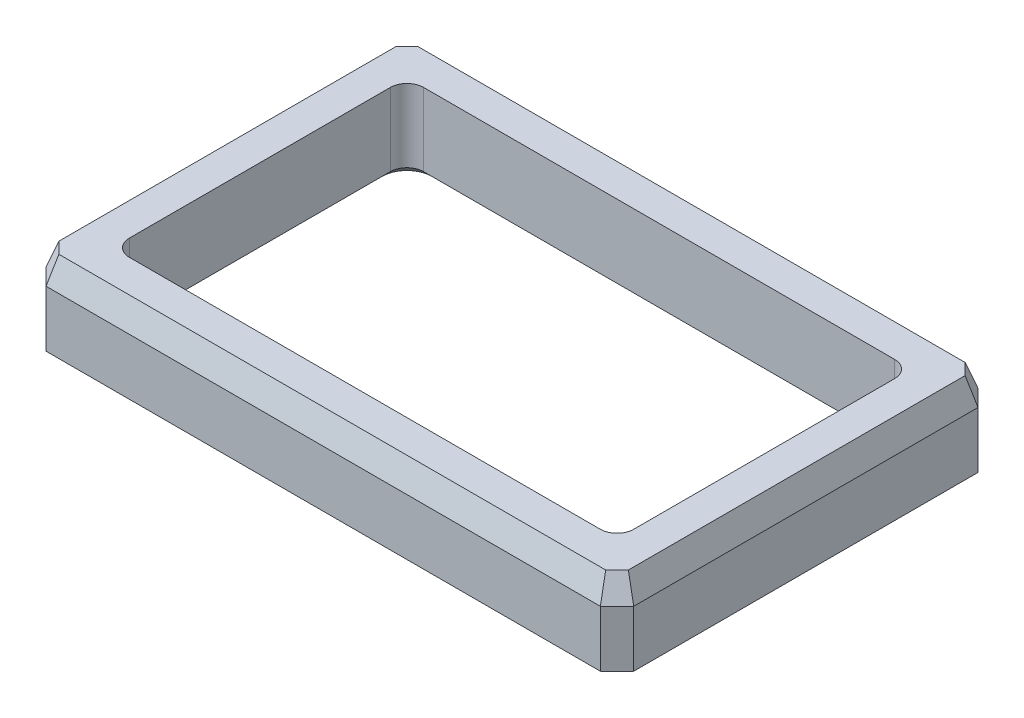
ISO-10303-21;
HEADER;
FILE_DESCRIPTION(('STEP AP214'),'2;1');
FILE_NAME('part.step','',(''),(''),'','','');
FILE_SCHEMA(('AUTOMOTIVE_DESIGN { 1 0 10303 214 1 1 1 1 }'));
ENDSEC;
DATA;
#1=APPLICATION_CONTEXT('core data for automotive mechanical design processes');
#2=APPLICATION_PROTOCOL_DEFINITION('international standard','automotive_design',2000,#1);
#3=PRODUCT_CONTEXT('',#1,'mechanical');
#4=PRODUCT('Part','Part','',(#3));
#5=PRODUCT_RELATED_PRODUCT_CATEGORY('part','',(#4));
#6=PRODUCT_DEFINITION_FORMATION('','',#4);
#7=PRODUCT_DEFINITION_CONTEXT('part definition',#1,'design');
#8=PRODUCT_DEFINITION('design','',#6,#7);
#9=PRODUCT_DEFINITION_SHAPE('','',#8);
#10=(LENGTH_UNIT() NAMED_UNIT(*) SI_UNIT(.MILLI.,.METRE.));
#11=(NAMED_UNIT(*) PLANE_ANGLE_UNIT() SI_UNIT($,.RADIAN.));
#12=(NAMED_UNIT(*) SI_UNIT($,.STERADIAN.) SOLID_ANGLE_UNIT());
#13=UNCERTAINTY_MEASURE_WITH_UNIT(LENGTH_MEASURE(1.E-05),#10,'distance_accuracy_value','');
#14=(GEOMETRIC_REPRESENTATION_CONTEXT(3) GLOBAL_UNCERTAINTY_ASSIGNED_CONTEXT((#13)) GLOBAL_UNIT_ASSIGNED_CONTEXT((#10,
#11,#12)) REPRESENTATION_CONTEXT('',''));
#15=CARTESIAN_POINT('',(0.,0.,0.));
#16=DIRECTION('',(0.,0.,1.));
#17=DIRECTION('',(1.,0.,0.));
#18=AXIS2_PLACEMENT_3D('',#15,#16,#17);
#19=CARTESIAN_POINT('',(35.25,171.493510504798,71.3));
#20=DIRECTION('',(-1.,0.,0.));
#21=DIRECTION('',(0.,0.,1.));
#22=AXIS2_PLACEMENT_3D('',#19,#20,#21);
#23=PLANE('',#22);
#24=DIRECTION('',(0.,1.,0.));
#25=VECTOR('',#24,1.);
#26=CARTESIAN_POINT('',(35.25,171.493510504798,73.3));
#27=LINE('',#26,#25);
#28=CARTESIAN_POINT('',(35.25,77.944107165633,73.3));
#29=VERTEX_POINT('',#28);
#30=CARTESIAN_POINT('',(35.25,84.6941071656329,73.3));
#31=VERTEX_POINT('',#30);
#32=EDGE_CURVE('E256',#29,#31,#27,.T.);
#33=ORIENTED_EDGE('',*,*,#32,.T.);
#34=DIRECTION('',(0.,0.,1.));
#35=VECTOR('',#34,1.);
#36=CARTESIAN_POINT('',(35.25,84.6941071656329,114.6));
#37=LINE('',#36,#35);
#38=CARTESIAN_POINT('',(35.25,84.6941071656329,114.6));
#39=VERTEX_POINT('',#38);
#40=EDGE_CURVE('E314',#31,#39,#37,.T.);
#41=ORIENTED_EDGE('',*,*,#40,.T.);
#42=DIRECTION('',(0.,-1.,0.));
#43=VECTOR('',#42,1.);
#44=CARTESIAN_POINT('',(35.25,171.493510504798,114.6));
#45=LINE('',#44,#43);
#46=CARTESIAN_POINT('',(35.25,77.944107165633,114.6));
#47=VERTEX_POINT('',#46);
#48=EDGE_CURVE('E254',#39,#47,#45,.T.);
#49=ORIENTED_EDGE('',*,*,#48,.T.);
#50=DIRECTION('',(0.,0.,-1.));
#51=VECTOR('',#50,1.);
#52=CARTESIAN_POINT('',(35.25,77.944107165633,71.3));
#53=LINE('',#52,#51);
#54=EDGE_CURVE('E237',#47,#29,#53,.T.);
#55=ORIENTED_EDGE('',*,*,#54,.T.);
#56=EDGE_LOOP('',(#33,#41,#49,#55));
#57=FACE_BOUND('',#56,.T.);
#58=ADVANCED_FACE('F40',(#57),#23,.F.);
#59=CARTESIAN_POINT('',(-35.25,171.493510504798,116.6));
#60=DIRECTION('',(0.,0.,-1.));
#61=DIRECTION('',(-1.,0.,0.));
#62=AXIS2_PLACEMENT_3D('',#59,#60,#61);
#63=PLANE('',#62);
#64=DIRECTION('',(0.,1.,0.));
#65=VECTOR('',#64,1.);
#66=CARTESIAN_POINT('',(33.25,171.493510504798,116.6));
#67=LINE('',#66,#65);
#68=CARTESIAN_POINT('',(33.25,77.944107165633,116.6));
#69=VERTEX_POINT('',#68);
#70=CARTESIAN_POINT('',(33.25,84.6941071656329,116.6));
#71=VERTEX_POINT('',#70);
#72=EDGE_CURVE('E259',#69,#71,#67,.T.);
#73=ORIENTED_EDGE('',*,*,#72,.T.);
#74=DIRECTION('',(-1.,0.,0.));
#75=VECTOR('',#74,1.);
#76=CARTESIAN_POINT('',(-33.25,84.6941071656329,116.6));
#77=LINE('',#76,#75);
#78=CARTESIAN_POINT('',(-33.25,84.6941071656329,116.6));
#79=VERTEX_POINT('',#78);
#80=EDGE_CURVE('E318',#71,#79,#77,.T.);
#81=ORIENTED_EDGE('',*,*,#80,.T.);
#82=DIRECTION('',(0.,-1.,0.));
#83=VECTOR('',#82,1.);
#84=CARTESIAN_POINT('',(-33.25,171.493510504798,116.6));
#85=LINE('',#84,#83);
#86=CARTESIAN_POINT('',(-33.25,77.944107165633,116.6));
#87=VERTEX_POINT('',#86);
#88=EDGE_CURVE('E262',#79,#87,#85,.T.);
#89=ORIENTED_EDGE('',*,*,#88,.T.);
#90=DIRECTION('',(1.,0.,0.));
#91=VECTOR('',#90,1.);
#92=CARTESIAN_POINT('',(-35.25,77.944107165633,116.6));
#93=LINE('',#92,#91);
#94=EDGE_CURVE('E233',#87,#69,#93,.T.);
#95=ORIENTED_EDGE('',*,*,#94,.T.);
#96=EDGE_LOOP('',(#73,#81,#89,#95));
#97=FACE_BOUND('',#96,.T.);
#98=ADVANCED_FACE('F475',(#97),#63,.F.);
#99=CARTESIAN_POINT('',(-35.25,171.493510504798,116.6));
#100=DIRECTION('',(1.,0.,0.));
#101=DIRECTION('',(0.,0.,-1.));
#102=AXIS2_PLACEMENT_3D('',#99,#100,#101);
#103=PLANE('',#102);
#104=DIRECTION('',(0.,1.,0.));
#105=VECTOR('',#104,1.);
#106=CARTESIAN_POINT('',(-35.25,171.493510504798,114.6));
#107=LINE('',#106,#105);
#108=CARTESIAN_POINT('',(-35.25,77.944107165633,114.6));
#109=VERTEX_POINT('',#108);
#110=CARTESIAN_POINT('',(-35.25,84.6941071656329,114.6));
#111=VERTEX_POINT('',#110);
#112=EDGE_CURVE('E216',#109,#111,#107,.T.);
#113=ORIENTED_EDGE('',*,*,#112,.T.);
#114=DIRECTION('',(0.,0.,-1.));
#115=VECTOR('',#114,1.);
#116=CARTESIAN_POINT('',(-35.25,84.6941071656329,73.3));
#117=LINE('',#116,#115);
#118=CARTESIAN_POINT('',(-35.25,84.6941071656329,73.3));
#119=VERTEX_POINT('',#118);
#120=EDGE_CURVE('E211',#111,#119,#117,.T.);
#121=ORIENTED_EDGE('',*,*,#120,.T.);
#122=DIRECTION('',(0.,-1.,0.));
#123=VECTOR('',#122,1.);
#124=CARTESIAN_POINT('',(-35.25,171.493510504798,73.3));
#125=LINE('',#124,#123);
#126=CARTESIAN_POINT('',(-35.25,77.944107165633,73.3));
#127=VERTEX_POINT('',#126);
#128=EDGE_CURVE('E203',#119,#127,#125,.T.);
#129=ORIENTED_EDGE('',*,*,#128,.T.);
#130=DIRECTION('',(0.,0.,1.));
#131=VECTOR('',#130,1.);
#132=CARTESIAN_POINT('',(-35.25,77.944107165633,116.6));
#133=LINE('',#132,#131);
#134=EDGE_CURVE('E208',#127,#109,#133,.T.);
#135=ORIENTED_EDGE('',*,*,#134,.T.);
#136=EDGE_LOOP('',(#113,#121,#129,#135));
#137=FACE_BOUND('',#136,.T.);
#138=ADVANCED_FACE('F206',(#137),#103,.F.);
#139=CARTESIAN_POINT('',(35.25,171.493510504798,71.3));
#140=DIRECTION('',(0.,0.,1.));
#141=DIRECTION('',(1.,0.,0.));
#142=AXIS2_PLACEMENT_3D('',#139,#140,#141);
#143=PLANE('',#142);
#144=DIRECTION('',(0.,1.,0.));
#145=VECTOR('',#144,1.);
#146=CARTESIAN_POINT('',(-33.25,171.493510504798,71.3));
#147=LINE('',#146,#145);
#148=CARTESIAN_POINT('',(-33.25,77.944107165633,71.3));
#149=VERTEX_POINT('',#148);
#150=CARTESIAN_POINT('',(-33.25,84.6941071656329,71.3));
#151=VERTEX_POINT('',#150);
#152=EDGE_CURVE('E222',#149,#151,#147,.T.);
#153=ORIENTED_EDGE('',*,*,#152,.T.);
#154=DIRECTION('',(1.,0.,0.));
#155=VECTOR('',#154,1.);
#156=CARTESIAN_POINT('',(33.25,84.6941071656329,71.3));
#157=LINE('',#156,#155);
#158=CARTESIAN_POINT('',(33.25,84.6941071656329,71.3));
#159=VERTEX_POINT('',#158);
#160=EDGE_CURVE('E310',#151,#159,#157,.T.);
#161=ORIENTED_EDGE('',*,*,#160,.T.);
#162=DIRECTION('',(0.,-1.,0.));
#163=VECTOR('',#162,1.);
#164=CARTESIAN_POINT('',(33.25,171.493510504798,71.3));
#165=LINE('',#164,#163);
#166=CARTESIAN_POINT('',(33.25,77.944107165633,71.3));
#167=VERTEX_POINT('',#166);
#168=EDGE_CURVE('E226',#159,#167,#165,.T.);
#169=ORIENTED_EDGE('',*,*,#168,.T.);
#170=DIRECTION('',(-1.,0.,0.));
#171=VECTOR('',#170,1.);
#172=CARTESIAN_POINT('',(35.25,77.944107165633,71.3));
#173=LINE('',#172,#171);
#174=EDGE_CURVE('E234',#167,#149,#173,.T.);
#175=ORIENTED_EDGE('',*,*,#174,.T.);
#176=EDGE_LOOP('',(#153,#161,#169,#175));
#177=FACE_BOUND('',#176,.T.);
#178=ADVANCED_FACE('F471',(#177),#143,.F.);
#179=CARTESIAN_POINT('',(0.,77.944107165633,0.));
#180=DIRECTION('',(0.,-1.,0.));
#181=DIRECTION('',(0.,0.,-1.));
#182=AXIS2_PLACEMENT_3D('',#179,#180,#181);
#183=PLANE('',#182);
#184=CARTESIAN_POINT('',(-28.25,77.944107165633,109.6));
#185=DIRECTION('',(0.,-1.,0.));
#186=DIRECTION('',(0.,0.,-1.));
#187=AXIS2_PLACEMENT_3D('',#184,#185,#186);
#188=CIRCLE('',#187,2.99999999999999);
#189=CARTESIAN_POINT('',(-31.25,77.944107165633,109.6));
#190=VERTEX_POINT('',#189);
#191=CARTESIAN_POINT('',(-28.25,77.944107165633,112.6));
#192=VERTEX_POINT('',#191);
#193=EDGE_CURVE('E356',#190,#192,#188,.F.);
#194=ORIENTED_EDGE('',*,*,#193,.T.);
#195=DIRECTION('',(1.,0.,0.));
#196=VECTOR('',#195,1.);
#197=CARTESIAN_POINT('',(0.,77.944107165633,112.6));
#198=LINE('',#197,#196);
#199=CARTESIAN_POINT('',(28.25,77.944107165633,112.6));
#200=VERTEX_POINT('',#199);
#201=EDGE_CURVE('E360',#192,#200,#198,.T.);
#202=ORIENTED_EDGE('',*,*,#201,.T.);
#203=CARTESIAN_POINT('',(28.25,77.944107165633,109.6));
#204=DIRECTION('',(0.,-1.,0.));
#205=DIRECTION('',(0.,0.,-1.));
#206=AXIS2_PLACEMENT_3D('',#203,#204,#205);
#207=CIRCLE('',#206,2.99999999999999);
#208=CARTESIAN_POINT('',(31.25,77.944107165633,109.6));
#209=VERTEX_POINT('',#208);
#210=EDGE_CURVE('E358',#200,#209,#207,.F.);
#211=ORIENTED_EDGE('',*,*,#210,.T.);
#212=DIRECTION('',(0.,0.,-1.));
#213=VECTOR('',#212,1.);
#214=CARTESIAN_POINT('',(31.25,77.944107165633,0.));
#215=LINE('',#214,#213);
#216=CARTESIAN_POINT('',(31.25,77.944107165633,78.3));
#217=VERTEX_POINT('',#216);
#218=EDGE_CURVE('E354',#209,#217,#215,.T.);
#219=ORIENTED_EDGE('',*,*,#218,.T.);
#220=CARTESIAN_POINT('',(28.25,77.944107165633,78.3));
#221=DIRECTION('',(0.,-1.,0.));
#222=DIRECTION('',(0.,0.,-1.));
#223=AXIS2_PLACEMENT_3D('',#220,#221,#222);
#224=CIRCLE('',#223,2.99999999999999);
#225=CARTESIAN_POINT('',(28.25,77.944107165633,75.3));
#226=VERTEX_POINT('',#225);
#227=EDGE_CURVE('E350',#217,#226,#224,.F.);
#228=ORIENTED_EDGE('',*,*,#227,.T.);
#229=DIRECTION('',(-1.,0.,0.));
#230=VECTOR('',#229,1.);
#231=CARTESIAN_POINT('',(0.,77.944107165633,75.3));
#232=LINE('',#231,#230);
#233=CARTESIAN_POINT('',(-28.25,77.944107165633,75.3));
#234=VERTEX_POINT('',#233);
#235=EDGE_CURVE('E323',#226,#234,#232,.T.);
#236=ORIENTED_EDGE('',*,*,#235,.T.);
#237=CARTESIAN_POINT('',(-28.25,77.944107165633,78.3));
#238=DIRECTION('',(0.,-1.,0.));
#239=DIRECTION('',(0.,0.,-1.));
#240=AXIS2_PLACEMENT_3D('',#237,#238,#239);
#241=CIRCLE('',#240,2.99999999999999);
#242=CARTESIAN_POINT('',(-31.25,77.944107165633,78.3));
#243=VERTEX_POINT('',#242);
#244=EDGE_CURVE('E348',#234,#243,#241,.F.);
#245=ORIENTED_EDGE('',*,*,#244,.T.);
#246=DIRECTION('',(0.,0.,1.));
#247=VECTOR('',#246,1.);
#248=CARTESIAN_POINT('',(-31.25,77.944107165633,0.));
#249=LINE('',#248,#247);
#250=EDGE_CURVE('E352',#243,#190,#249,.T.);
#251=ORIENTED_EDGE('',*,*,#250,.T.);
#252=EDGE_LOOP('',(#194,#202,#211,#219,#228,#236,#245,#251));
#253=FACE_BOUND('',#252,.T.);
#254=ORIENTED_EDGE('',*,*,#134,.F.);
#255=DIRECTION('',(-0.707106781186548,0.,0.707106781186548));
#256=VECTOR('',#255,1.);
#257=CARTESIAN_POINT('',(19.025,77.944107165633,19.025));
#258=LINE('',#257,#256);
#259=EDGE_CURVE('E219',#127,#149,#258,.F.);
#260=ORIENTED_EDGE('',*,*,#259,.T.);
#261=ORIENTED_EDGE('',*,*,#174,.F.);
#262=DIRECTION('',(-0.707106781186545,0.,-0.70710678118655));
#263=VECTOR('',#262,1.);
#264=CARTESIAN_POINT('',(-19.0249999999999,77.944107165633,19.0249999999998));
#265=LINE('',#264,#263);
#266=EDGE_CURVE('E227',#167,#29,#265,.F.);
#267=ORIENTED_EDGE('',*,*,#266,.T.);
#268=ORIENTED_EDGE('',*,*,#54,.F.);
#269=DIRECTION('',(0.70710678118655,0.,-0.707106781186545));
#270=VECTOR('',#269,1.);
#271=CARTESIAN_POINT('',(74.9249999999999,77.944107165633,74.9250000000004));
#272=LINE('',#271,#270);
#273=EDGE_CURVE('E215',#47,#69,#272,.F.);
#274=ORIENTED_EDGE('',*,*,#273,.T.);
#275=ORIENTED_EDGE('',*,*,#94,.F.);
#276=DIRECTION('',(0.707106781186546,0.,0.707106781186549));
#277=VECTOR('',#276,1.);
#278=CARTESIAN_POINT('',(-74.9250000000001,77.944107165633,74.9249999999998));
#279=LINE('',#278,#277);
#280=EDGE_CURVE('E232',#87,#109,#279,.F.);
#281=ORIENTED_EDGE('',*,*,#280,.T.);
#282=EDGE_LOOP('',(#254,#260,#261,#267,#268,#274,#275,#281));
#283=FACE_BOUND('',#282,.T.);
#284=ADVANCED_FACE('F229',(#253,#283),#183,.T.);
#285=CARTESIAN_POINT('',(30.25,171.493510504798,76.3));
#286=DIRECTION('',(0.,0.,1.));
#287=DIRECTION('',(1.,0.,0.));
#288=AXIS2_PLACEMENT_3D('',#285,#286,#287);
#289=PLANE('',#288);
#290=DIRECTION('',(0.,-1.,0.));
#291=VECTOR('',#290,1.);
#292=CARTESIAN_POINT('',(-28.25,77.944107165633,76.3));
#293=LINE('',#292,#291);
#294=CARTESIAN_POINT('',(-28.25,87.6941071656329,76.3));
#295=VERTEX_POINT('',#294);
#296=CARTESIAN_POINT('',(-28.25,78.9441071656329,76.3));
#297=VERTEX_POINT('',#296);
#298=EDGE_CURVE('E269',#295,#297,#293,.T.);
#299=ORIENTED_EDGE('',*,*,#298,.T.);
#300=DIRECTION('',(1.,0.,0.));
#301=VECTOR('',#300,1.);
#302=CARTESIAN_POINT('',(30.25,78.9441071656329,76.3));
#303=LINE('',#302,#301);
#304=CARTESIAN_POINT('',(28.25,78.9441071656329,76.3));
#305=VERTEX_POINT('',#304);
#306=EDGE_CURVE('E11',#297,#305,#303,.T.);
#307=ORIENTED_EDGE('',*,*,#306,.T.);
#308=DIRECTION('',(0.,-1.,0.));
#309=VECTOR('',#308,1.);
#310=CARTESIAN_POINT('',(28.25,87.6941071656329,76.3));
#311=LINE('',#310,#309);
#312=CARTESIAN_POINT('',(28.25,87.6941071656329,76.3));
#313=VERTEX_POINT('',#312);
#314=EDGE_CURVE('E271',#305,#313,#311,.F.);
#315=ORIENTED_EDGE('',*,*,#314,.T.);
#316=DIRECTION('',(-1.,0.,0.));
#317=VECTOR('',#316,1.);
#318=CARTESIAN_POINT('',(30.25,87.6941071656329,76.3));
#319=LINE('',#318,#317);
#320=EDGE_CURVE('E245',#313,#295,#319,.T.);
#321=ORIENTED_EDGE('',*,*,#320,.T.);
#322=EDGE_LOOP('',(#299,#307,#315,#321));
#323=FACE_BOUND('',#322,.T.);
#324=ADVANCED_FACE('F463',(#323),#289,.T.);
#325=CARTESIAN_POINT('',(30.25,171.493510504798,111.6));
#326=DIRECTION('',(-1.,0.,0.));
#327=DIRECTION('',(0.,0.,1.));
#328=AXIS2_PLACEMENT_3D('',#325,#326,#327);
#329=PLANE('',#328);
#330=DIRECTION('',(0.,-1.,0.));
#331=VECTOR('',#330,1.);
#332=CARTESIAN_POINT('',(30.25,77.944107165633,78.3));
#333=LINE('',#332,#331);
#334=CARTESIAN_POINT('',(30.25,87.6941071656329,78.3));
#335=VERTEX_POINT('',#334);
#336=CARTESIAN_POINT('',(30.25,78.9441071656329,78.3));
#337=VERTEX_POINT('',#336);
#338=EDGE_CURVE('E266',#335,#337,#333,.T.);
#339=ORIENTED_EDGE('',*,*,#338,.T.);
#340=DIRECTION('',(0.,0.,1.));
#341=VECTOR('',#340,1.);
#342=CARTESIAN_POINT('',(30.25,78.9441071656329,111.6));
#343=LINE('',#342,#341);
#344=CARTESIAN_POINT('',(30.25,78.9441071656329,109.6));
#345=VERTEX_POINT('',#344);
#346=EDGE_CURVE('E370',#337,#345,#343,.T.);
#347=ORIENTED_EDGE('',*,*,#346,.T.);
#348=DIRECTION('',(0.,-1.,0.));
#349=VECTOR('',#348,1.);
#350=CARTESIAN_POINT('',(30.25,87.6941071656329,109.6));
#351=LINE('',#350,#349);
#352=CARTESIAN_POINT('',(30.25,87.6941071656329,109.6));
#353=VERTEX_POINT('',#352);
#354=EDGE_CURVE('E264',#345,#353,#351,.F.);
#355=ORIENTED_EDGE('',*,*,#354,.T.);
#356=DIRECTION('',(0.,0.,-1.));
#357=VECTOR('',#356,1.);
#358=CARTESIAN_POINT('',(30.25,87.6941071656329,111.6));
#359=LINE('',#358,#357);
#360=EDGE_CURVE('E346',#353,#335,#359,.T.);
#361=ORIENTED_EDGE('',*,*,#360,.T.);
#362=EDGE_LOOP('',(#339,#347,#355,#361));
#363=FACE_BOUND('',#362,.T.);
#364=ADVANCED_FACE('F415',(#363),#329,.T.);
#365=CARTESIAN_POINT('',(-30.25,171.493510504798,111.6));
#366=DIRECTION('',(0.,0.,-1.));
#367=DIRECTION('',(-1.,0.,0.));
#368=AXIS2_PLACEMENT_3D('',#365,#366,#367);
#369=PLANE('',#368);
#370=DIRECTION('',(0.,-1.,0.));
#371=VECTOR('',#370,1.);
#372=CARTESIAN_POINT('',(28.25,77.944107165633,111.6));
#373=LINE('',#372,#371);
#374=CARTESIAN_POINT('',(28.25,87.6941071656329,111.6));
#375=VERTEX_POINT('',#374);
#376=CARTESIAN_POINT('',(28.25,78.9441071656329,111.6));
#377=VERTEX_POINT('',#376);
#378=EDGE_CURVE('E275',#375,#377,#373,.T.);
#379=ORIENTED_EDGE('',*,*,#378,.T.);
#380=DIRECTION('',(-1.,0.,0.));
#381=VECTOR('',#380,1.);
#382=CARTESIAN_POINT('',(-30.25,78.9441071656329,111.6));
#383=LINE('',#382,#381);
#384=CARTESIAN_POINT('',(-28.25,78.9441071656329,111.6));
#385=VERTEX_POINT('',#384);
#386=EDGE_CURVE('E363',#377,#385,#383,.T.);
#387=ORIENTED_EDGE('',*,*,#386,.T.);
#388=DIRECTION('',(0.,-1.,0.));
#389=VECTOR('',#388,1.);
#390=CARTESIAN_POINT('',(-28.25,87.6941071656329,111.6));
#391=LINE('',#390,#389);
#392=CARTESIAN_POINT('',(-28.25,87.6941071656329,111.6));
#393=VERTEX_POINT('',#392);
#394=EDGE_CURVE('E273',#385,#393,#391,.F.);
#395=ORIENTED_EDGE('',*,*,#394,.T.);
#396=DIRECTION('',(1.,0.,0.));
#397=VECTOR('',#396,1.);
#398=CARTESIAN_POINT('',(-30.25,87.6941071656329,111.6));
#399=LINE('',#398,#397);
#400=EDGE_CURVE('E420',#393,#375,#399,.T.);
#401=ORIENTED_EDGE('',*,*,#400,.T.);
#402=EDGE_LOOP('',(#379,#387,#395,#401));
#403=FACE_BOUND('',#402,.T.);
#404=ADVANCED_FACE('F444',(#403),#369,.T.);
#405=CARTESIAN_POINT('',(-30.25,171.493510504798,76.3));
#406=DIRECTION('',(1.,0.,0.));
#407=DIRECTION('',(0.,0.,-1.));
#408=AXIS2_PLACEMENT_3D('',#405,#406,#407);
#409=PLANE('',#408);
#410=DIRECTION('',(0.,-1.,0.));
#411=VECTOR('',#410,1.);
#412=CARTESIAN_POINT('',(-30.25,77.944107165633,109.6));
#413=LINE('',#412,#411);
#414=CARTESIAN_POINT('',(-30.25,87.6941071656329,109.6));
#415=VERTEX_POINT('',#414);
#416=CARTESIAN_POINT('',(-30.25,78.9441071656329,109.6));
#417=VERTEX_POINT('',#416);
#418=EDGE_CURVE('E280',#415,#417,#413,.T.);
#419=ORIENTED_EDGE('',*,*,#418,.T.);
#420=DIRECTION('',(0.,0.,-1.));
#421=VECTOR('',#420,1.);
#422=CARTESIAN_POINT('',(-30.25,78.9441071656329,76.3));
#423=LINE('',#422,#421);
#424=CARTESIAN_POINT('',(-30.25,78.9441071656329,78.3));
#425=VERTEX_POINT('',#424);
#426=EDGE_CURVE('E372',#417,#425,#423,.T.);
#427=ORIENTED_EDGE('',*,*,#426,.T.);
#428=DIRECTION('',(0.,-1.,0.));
#429=VECTOR('',#428,1.);
#430=CARTESIAN_POINT('',(-30.25,87.6941071656329,78.3));
#431=LINE('',#430,#429);
#432=CARTESIAN_POINT('',(-30.25,87.6941071656329,78.3));
#433=VERTEX_POINT('',#432);
#434=EDGE_CURVE('E278',#425,#433,#431,.F.);
#435=ORIENTED_EDGE('',*,*,#434,.T.);
#436=DIRECTION('',(0.,0.,1.));
#437=VECTOR('',#436,1.);
#438=CARTESIAN_POINT('',(-30.25,87.6941071656329,76.3));
#439=LINE('',#438,#437);
#440=EDGE_CURVE('E239',#433,#415,#439,.T.);
#441=ORIENTED_EDGE('',*,*,#440,.T.);
#442=EDGE_LOOP('',(#419,#427,#435,#441));
#443=FACE_BOUND('',#442,.T.);
#444=ADVANCED_FACE('F428',(#443),#409,.T.);
#445=CARTESIAN_POINT('',(-33.7,87.6941071656329,73.95));
#446=DIRECTION('',(0.,1.,0.));
#447=DIRECTION('',(0.,0.,1.));
#448=AXIS2_PLACEMENT_3D('',#445,#446,#447);
#449=PLANE('',#448);
#450=DIRECTION('',(-1.,0.,0.));
#451=VECTOR('',#450,1.);
#452=CARTESIAN_POINT('',(-33.25,87.6941071656329,72.3919107027986));
#453=LINE('',#452,#451);
#454=CARTESIAN_POINT('',(32.7977157780005,87.6941071656329,72.3919107027986));
#455=VERTEX_POINT('',#454);
#456=CARTESIAN_POINT('',(-32.7977157780005,87.6941071656329,72.3919107027986));
#457=VERTEX_POINT('',#456);
#458=EDGE_CURVE('E303',#455,#457,#453,.T.);
#459=ORIENTED_EDGE('',*,*,#458,.T.);
#460=DIRECTION('',(-0.707106781186548,0.,0.707106781186548));
#461=VECTOR('',#460,1.);
#462=CARTESIAN_POINT('',(-34.0279025376009,87.6941071656329,73.6220974623991));
#463=LINE('',#462,#461);
#464=CARTESIAN_POINT('',(-34.1580892972014,87.6941071656329,73.7522842219995));
#465=VERTEX_POINT('',#464);
#466=EDGE_CURVE('E305',#457,#465,#463,.T.);
#467=ORIENTED_EDGE('',*,*,#466,.T.);
#468=DIRECTION('',(0.,0.,1.));
#469=VECTOR('',#468,1.);
#470=CARTESIAN_POINT('',(-34.1580892972014,87.6941071656329,114.6));
#471=LINE('',#470,#469);
#472=CARTESIAN_POINT('',(-34.1580892972014,87.6941071656329,114.147715778));
#473=VERTEX_POINT('',#472);
#474=EDGE_CURVE('E291',#465,#473,#471,.T.);
#475=ORIENTED_EDGE('',*,*,#474,.T.);
#476=DIRECTION('',(0.707106781186546,0.,0.707106781186549));
#477=VECTOR('',#476,1.);
#478=CARTESIAN_POINT('',(-54.0279025376009,87.6941071656329,94.2779025376009));
#479=LINE('',#478,#477);
#480=CARTESIAN_POINT('',(-32.7977157780005,87.6941071656329,115.508089297201));
#481=VERTEX_POINT('',#480);
#482=EDGE_CURVE('E293',#473,#481,#479,.T.);
#483=ORIENTED_EDGE('',*,*,#482,.T.);
#484=DIRECTION('',(1.,0.,0.));
#485=VECTOR('',#484,1.);
#486=CARTESIAN_POINT('',(33.25,87.6941071656329,115.508089297201));
#487=LINE('',#486,#485);
#488=CARTESIAN_POINT('',(32.7977157780004,87.6941071656329,115.508089297201));
#489=VERTEX_POINT('',#488);
#490=EDGE_CURVE('E295',#481,#489,#487,.T.);
#491=ORIENTED_EDGE('',*,*,#490,.T.);
#492=DIRECTION('',(0.70710678118655,0.,-0.707106781186545));
#493=VECTOR('',#492,1.);
#494=CARTESIAN_POINT('',(20.3279025376007,87.6941071656329,127.977902537601));
#495=LINE('',#494,#493);
#496=CARTESIAN_POINT('',(34.1580892972014,87.6941071656329,114.147715778));
#497=VERTEX_POINT('',#496);
#498=EDGE_CURVE('E297',#489,#497,#495,.T.);
#499=ORIENTED_EDGE('',*,*,#498,.T.);
#500=DIRECTION('',(0.,0.,-1.));
#501=VECTOR('',#500,1.);
#502=CARTESIAN_POINT('',(34.1580892972014,87.6941071656329,73.3));
#503=LINE('',#502,#501);
#504=CARTESIAN_POINT('',(34.1580892972014,87.6941071656329,73.7522842219996));
#505=VERTEX_POINT('',#504);
#506=EDGE_CURVE('E299',#497,#505,#503,.T.);
#507=ORIENTED_EDGE('',*,*,#506,.T.);
#508=DIRECTION('',(-0.707106781186545,0.,-0.70710678118655));
#509=VECTOR('',#508,1.);
#510=CARTESIAN_POINT('',(0.327902537601149,87.6941071656329,39.9220974623991));
#511=LINE('',#510,#509);
#512=EDGE_CURVE('E301',#505,#455,#511,.T.);
#513=ORIENTED_EDGE('',*,*,#512,.T.);
#514=EDGE_LOOP('',(#459,#467,#475,#483,#491,#499,#507,#513));
#515=FACE_BOUND('',#514,.T.);
#516=ORIENTED_EDGE('',*,*,#440,.F.);
#517=CARTESIAN_POINT('',(-28.25,87.6941071656329,78.3));
#518=DIRECTION('',(0.,1.,0.));
#519=DIRECTION('',(0.,0.,1.));
#520=AXIS2_PLACEMENT_3D('',#517,#518,#519);
#521=CIRCLE('',#520,2.);
#522=EDGE_CURVE('E289',#433,#295,#521,.F.);
#523=ORIENTED_EDGE('',*,*,#522,.T.);
#524=ORIENTED_EDGE('',*,*,#320,.F.);
#525=CARTESIAN_POINT('',(28.25,87.6941071656329,78.3));
#526=DIRECTION('',(0.,1.,0.));
#527=DIRECTION('',(0.,0.,1.));
#528=AXIS2_PLACEMENT_3D('',#525,#526,#527);
#529=CIRCLE('',#528,2.);
#530=EDGE_CURVE('E283',#313,#335,#529,.F.);
#531=ORIENTED_EDGE('',*,*,#530,.T.);
#532=ORIENTED_EDGE('',*,*,#360,.F.);
#533=CARTESIAN_POINT('',(28.25,87.6941071656329,109.6));
#534=DIRECTION('',(0.,1.,0.));
#535=DIRECTION('',(0.,0.,1.));
#536=AXIS2_PLACEMENT_3D('',#533,#534,#535);
#537=CIRCLE('',#536,2.);
#538=EDGE_CURVE('E285',#353,#375,#537,.F.);
#539=ORIENTED_EDGE('',*,*,#538,.T.);
#540=ORIENTED_EDGE('',*,*,#400,.F.);
#541=CARTESIAN_POINT('',(-28.25,87.6941071656329,109.6));
#542=DIRECTION('',(0.,1.,0.));
#543=DIRECTION('',(0.,0.,1.));
#544=AXIS2_PLACEMENT_3D('',#541,#542,#543);
#545=CIRCLE('',#544,2.);
#546=EDGE_CURVE('E287',#393,#415,#545,.F.);
#547=ORIENTED_EDGE('',*,*,#546,.T.);
#548=EDGE_LOOP('',(#516,#523,#524,#531,#532,#539,#540,#547));
#549=FACE_BOUND('',#548,.T.);
#550=ADVANCED_FACE('F462',(#515,#549),#449,.T.);
#551=CARTESIAN_POINT('',(-35.25,171.493510504798,73.3));
#552=DIRECTION('',(0.707106781186547,0.,0.707106781186547));
#553=DIRECTION('',(0.,-1.,0.));
#554=AXIS2_PLACEMENT_3D('',#551,#552,#553);
#555=PLANE('',#554);
#556=ORIENTED_EDGE('',*,*,#128,.F.);
#557=DIRECTION('',(-0.707106781186548,0.,0.707106781186548));
#558=VECTOR('',#557,1.);
#559=CARTESIAN_POINT('',(-35.25,84.6941071656329,73.3));
#560=LINE('',#559,#558);
#561=EDGE_CURVE('E308',#119,#151,#560,.F.);
#562=ORIENTED_EDGE('',*,*,#561,.T.);
#563=ORIENTED_EDGE('',*,*,#152,.F.);
#564=ORIENTED_EDGE('',*,*,#259,.F.);
#565=EDGE_LOOP('',(#556,#562,#563,#564));
#566=FACE_BOUND('',#565,.T.);
#567=ADVANCED_FACE('F220',(#566),#555,.F.);
#568=CARTESIAN_POINT('',(33.25,171.493510504798,71.3));
#569=DIRECTION('',(-0.70710678118655,0.,0.707106781186545));
#570=DIRECTION('',(0.,-1.,0.));
#571=AXIS2_PLACEMENT_3D('',#568,#569,#570);
#572=PLANE('',#571);
#573=ORIENTED_EDGE('',*,*,#168,.F.);
#574=DIRECTION('',(-0.707106781186545,0.,-0.70710678118655));
#575=VECTOR('',#574,1.);
#576=CARTESIAN_POINT('',(33.25,84.6941071656329,71.3));
#577=LINE('',#576,#575);
#578=EDGE_CURVE('E312',#159,#31,#577,.F.);
#579=ORIENTED_EDGE('',*,*,#578,.T.);
#580=ORIENTED_EDGE('',*,*,#32,.F.);
#581=ORIENTED_EDGE('',*,*,#266,.F.);
#582=EDGE_LOOP('',(#573,#579,#580,#581));
#583=FACE_BOUND('',#582,.T.);
#584=ADVANCED_FACE('F496',(#583),#572,.F.);
#585=CARTESIAN_POINT('',(-33.25,171.493510504798,116.6));
#586=DIRECTION('',(0.707106781186549,0.,-0.707106781186546));
#587=DIRECTION('',(0.,-1.,0.));
#588=AXIS2_PLACEMENT_3D('',#585,#586,#587);
#589=PLANE('',#588);
#590=ORIENTED_EDGE('',*,*,#88,.F.);
#591=DIRECTION('',(0.707106781186546,0.,0.707106781186549));
#592=VECTOR('',#591,1.);
#593=CARTESIAN_POINT('',(-33.25,84.6941071656329,116.6));
#594=LINE('',#593,#592);
#595=EDGE_CURVE('E320',#79,#111,#594,.F.);
#596=ORIENTED_EDGE('',*,*,#595,.T.);
#597=ORIENTED_EDGE('',*,*,#112,.F.);
#598=ORIENTED_EDGE('',*,*,#280,.F.);
#599=EDGE_LOOP('',(#590,#596,#597,#598));
#600=FACE_BOUND('',#599,.T.);
#601=ADVANCED_FACE('F502',(#600),#589,.F.);
#602=CARTESIAN_POINT('',(35.25,171.493510504798,114.6));
#603=DIRECTION('',(-0.707106781186545,0.,-0.70710678118655));
#604=DIRECTION('',(0.,-1.,0.));
#605=AXIS2_PLACEMENT_3D('',#602,#603,#604);
#606=PLANE('',#605);
#607=ORIENTED_EDGE('',*,*,#48,.F.);
#608=DIRECTION('',(0.70710678118655,0.,-0.707106781186545));
#609=VECTOR('',#608,1.);
#610=CARTESIAN_POINT('',(35.25,84.6941071656329,114.6));
#611=LINE('',#610,#609);
#612=EDGE_CURVE('E316',#39,#71,#611,.F.);
#613=ORIENTED_EDGE('',*,*,#612,.T.);
#614=ORIENTED_EDGE('',*,*,#72,.F.);
#615=ORIENTED_EDGE('',*,*,#273,.F.);
#616=EDGE_LOOP('',(#607,#613,#614,#615));
#617=FACE_BOUND('',#616,.T.);
#618=ADVANCED_FACE('F509',(#617),#606,.F.);
#619=CARTESIAN_POINT('',(28.25,171.493510504798,78.3));
#620=DIRECTION('',(0.,1.,0.));
#621=DIRECTION('',(0.,0.,1.));
#622=AXIS2_PLACEMENT_3D('',#619,#620,#621);
#623=CYLINDRICAL_SURFACE('',#622,2.);
#624=ORIENTED_EDGE('',*,*,#314,.F.);
#625=CARTESIAN_POINT('',(28.25,78.9441071656329,78.3));
#626=DIRECTION('',(0.,-1.,0.));
#627=DIRECTION('',(0.,0.,-1.));
#628=AXIS2_PLACEMENT_3D('',#625,#626,#627);
#629=CIRCLE('',#628,2.);
#630=EDGE_CURVE('E374',#305,#337,#629,.T.);
#631=ORIENTED_EDGE('',*,*,#630,.T.);
#632=ORIENTED_EDGE('',*,*,#338,.F.);
#633=ORIENTED_EDGE('',*,*,#530,.F.);
#634=EDGE_LOOP('',(#624,#631,#632,#633));
#635=FACE_BOUND('',#634,.T.);
#636=ADVANCED_FACE('F411',(#635),#623,.F.);
#637=CARTESIAN_POINT('',(28.25,171.493510504798,109.6));
#638=DIRECTION('',(0.,1.,0.));
#639=DIRECTION('',(0.,0.,1.));
#640=AXIS2_PLACEMENT_3D('',#637,#638,#639);
#641=CYLINDRICAL_SURFACE('',#640,2.);
#642=ORIENTED_EDGE('',*,*,#354,.F.);
#643=CARTESIAN_POINT('',(28.25,78.9441071656329,109.6));
#644=DIRECTION('',(0.,-1.,0.));
#645=DIRECTION('',(0.,0.,-1.));
#646=AXIS2_PLACEMENT_3D('',#643,#644,#645);
#647=CIRCLE('',#646,2.);
#648=EDGE_CURVE('E366',#345,#377,#647,.T.);
#649=ORIENTED_EDGE('',*,*,#648,.T.);
#650=ORIENTED_EDGE('',*,*,#378,.F.);
#651=ORIENTED_EDGE('',*,*,#538,.F.);
#652=EDGE_LOOP('',(#642,#649,#650,#651));
#653=FACE_BOUND('',#652,.T.);
#654=ADVANCED_FACE('F519',(#653),#641,.F.);
#655=CARTESIAN_POINT('',(-28.25,171.493510504798,109.6));
#656=DIRECTION('',(0.,1.,0.));
#657=DIRECTION('',(0.,0.,1.));
#658=AXIS2_PLACEMENT_3D('',#655,#656,#657);
#659=CYLINDRICAL_SURFACE('',#658,2.);
#660=ORIENTED_EDGE('',*,*,#394,.F.);
#661=CARTESIAN_POINT('',(-28.25,78.9441071656329,109.6));
#662=DIRECTION('',(0.,-1.,0.));
#663=DIRECTION('',(0.,0.,-1.));
#664=AXIS2_PLACEMENT_3D('',#661,#662,#663);
#665=CIRCLE('',#664,2.);
#666=EDGE_CURVE('E368',#385,#417,#665,.T.);
#667=ORIENTED_EDGE('',*,*,#666,.T.);
#668=ORIENTED_EDGE('',*,*,#418,.F.);
#669=ORIENTED_EDGE('',*,*,#546,.F.);
#670=EDGE_LOOP('',(#660,#667,#668,#669));
#671=FACE_BOUND('',#670,.T.);
#672=ADVANCED_FACE('F434',(#671),#659,.F.);
#673=CARTESIAN_POINT('',(-28.25,171.493510504798,78.3));
#674=DIRECTION('',(0.,1.,0.));
#675=DIRECTION('',(0.,0.,1.));
#676=AXIS2_PLACEMENT_3D('',#673,#674,#675);
#677=CYLINDRICAL_SURFACE('',#676,2.);
#678=ORIENTED_EDGE('',*,*,#434,.F.);
#679=CARTESIAN_POINT('',(-28.25,78.9441071656329,78.3));
#680=DIRECTION('',(0.,-1.,0.));
#681=DIRECTION('',(0.,0.,-1.));
#682=AXIS2_PLACEMENT_3D('',#679,#680,#681);
#683=CIRCLE('',#682,2.);
#684=EDGE_CURVE('E50',#425,#297,#683,.T.);
#685=ORIENTED_EDGE('',*,*,#684,.T.);
#686=ORIENTED_EDGE('',*,*,#298,.F.);
#687=ORIENTED_EDGE('',*,*,#522,.F.);
#688=EDGE_LOOP('',(#678,#685,#686,#687));
#689=FACE_BOUND('',#688,.T.);
#690=ADVANCED_FACE('F460',(#689),#677,.F.);
#691=CARTESIAN_POINT('',(20.3279025376007,87.6941071656329,127.977902537601));
#692=DIRECTION('',(0.664463024388674,0.342020143325664,0.664463024388678));
#693=DIRECTION('',(-0.70710678118655,0.,0.707106781186545));
#694=AXIS2_PLACEMENT_3D('',#691,#692,#693);
#695=PLANE('',#694);
#696=DIRECTION('',(-0.140268762712275,0.930402317101584,-0.338638749317278));
#697=VECTOR('',#696,1.);
#698=CARTESIAN_POINT('',(31.4893515555891,96.3724834527419,112.349418646932));
#699=LINE('',#698,#697);
#700=EDGE_CURVE('E340',#71,#489,#699,.T.);
#701=ORIENTED_EDGE('',*,*,#700,.F.);
#702=ORIENTED_EDGE('',*,*,#612,.F.);
#703=DIRECTION('',(-0.338638749317276,0.930402317101585,-0.140268762712279));
#704=VECTOR('',#703,1.);
#705=CARTESIAN_POINT('',(33.2290359330667,90.2466603050614,113.762889274408));
#706=LINE('',#705,#704);
#707=EDGE_CURVE('E343',#497,#39,#706,.F.);
#708=ORIENTED_EDGE('',*,*,#707,.F.);
#709=ORIENTED_EDGE('',*,*,#498,.F.);
#710=EDGE_LOOP('',(#701,#702,#708,#709));
#711=FACE_BOUND('',#710,.T.);
#712=ADVANCED_FACE('F527',(#711),#695,.T.);
#713=CARTESIAN_POINT('',(34.1580892972014,87.6941071656329,73.95));
#714=DIRECTION('',(0.93969262078591,0.342020143325664,0.));
#715=DIRECTION('',(0.,0.,1.));
#716=AXIS2_PLACEMENT_3D('',#713,#714,#715);
#717=PLANE('',#716);
#718=ORIENTED_EDGE('',*,*,#707,.T.);
#719=ORIENTED_EDGE('',*,*,#40,.F.);
#720=DIRECTION('',(-0.338638749317276,0.930402317101585,0.140268762712279));
#721=VECTOR('',#720,1.);
#722=CARTESIAN_POINT('',(34.1486977110731,87.7199103364534,73.7561743443461));
#723=LINE('',#722,#721);
#724=EDGE_CURVE('E337',#505,#31,#723,.F.);
#725=ORIENTED_EDGE('',*,*,#724,.F.);
#726=ORIENTED_EDGE('',*,*,#506,.F.);
#727=EDGE_LOOP('',(#718,#719,#725,#726));
#728=FACE_BOUND('',#727,.T.);
#729=ADVANCED_FACE('F570',(#728),#717,.T.);
#730=CARTESIAN_POINT('',(-33.7,87.6941071656329,115.508089297201));
#731=DIRECTION('',(0.,0.342020143325666,0.939692620785909));
#732=DIRECTION('',(-1.,0.,0.));
#733=AXIS2_PLACEMENT_3D('',#730,#731,#732);
#734=PLANE('',#733);
#735=ORIENTED_EDGE('',*,*,#700,.T.);
#736=ORIENTED_EDGE('',*,*,#490,.F.);
#737=DIRECTION('',(0.140268762712279,0.930402317101584,-0.338638749317278));
#738=VECTOR('',#737,1.);
#739=CARTESIAN_POINT('',(-32.206983441313,91.6124331293986,114.081935278238));
#740=LINE('',#739,#738);
#741=EDGE_CURVE('E334',#79,#481,#740,.T.);
#742=ORIENTED_EDGE('',*,*,#741,.F.);
#743=ORIENTED_EDGE('',*,*,#80,.F.);
#744=EDGE_LOOP('',(#735,#736,#742,#743));
#745=FACE_BOUND('',#744,.T.);
#746=ADVANCED_FACE('F563',(#745),#734,.T.);
#747=CARTESIAN_POINT('',(0.327902537601149,87.6941071656329,39.9220974623991));
#748=DIRECTION('',(0.664463024388678,0.342020143325665,-0.664463024388673));
#749=DIRECTION('',(0.707106781186545,0.,0.70710678118655));
#750=AXIS2_PLACEMENT_3D('',#747,#748,#749);
#751=PLANE('',#750);
#752=ORIENTED_EDGE('',*,*,#724,.T.);
#753=ORIENTED_EDGE('',*,*,#578,.F.);
#754=DIRECTION('',(-0.140268762712278,0.930402317101584,0.338638749317278));
#755=VECTOR('',#754,1.);
#756=CARTESIAN_POINT('',(33.701191986877,81.7013519581948,70.2107261860474));
#757=LINE('',#756,#755);
#758=EDGE_CURVE('E331',#455,#159,#757,.F.);
#759=ORIENTED_EDGE('',*,*,#758,.F.);
#760=ORIENTED_EDGE('',*,*,#512,.F.);
#761=EDGE_LOOP('',(#752,#753,#759,#760));
#762=FACE_BOUND('',#761,.T.);
#763=ADVANCED_FACE('F556',(#762),#751,.T.);
#764=CARTESIAN_POINT('',(-54.0279025376009,87.6941071656329,94.2779025376009));
#765=DIRECTION('',(-0.664463024388677,0.342020143325665,0.664463024388675));
#766=DIRECTION('',(-0.707106781186546,0.,-0.707106781186549));
#767=AXIS2_PLACEMENT_3D('',#764,#765,#766);
#768=PLANE('',#767);
#769=ORIENTED_EDGE('',*,*,#741,.T.);
#770=ORIENTED_EDGE('',*,*,#482,.F.);
#771=DIRECTION('',(0.338638749317276,0.930402317101584,-0.14026876271228));
#772=VECTOR('',#771,1.);
#773=CARTESIAN_POINT('',(-32.2486801761464,92.9401656102325,113.356812623941));
#774=LINE('',#773,#772);
#775=EDGE_CURVE('E328',#111,#473,#774,.T.);
#776=ORIENTED_EDGE('',*,*,#775,.F.);
#777=ORIENTED_EDGE('',*,*,#595,.F.);
#778=EDGE_LOOP('',(#769,#770,#776,#777));
#779=FACE_BOUND('',#778,.T.);
#780=ADVANCED_FACE('F549',(#779),#768,.T.);
#781=CARTESIAN_POINT('',(-33.7,87.6941071656329,72.3919107027986));
#782=DIRECTION('',(0.,0.342020143325666,-0.939692620785909));
#783=DIRECTION('',(1.,0.,0.));
#784=AXIS2_PLACEMENT_3D('',#781,#782,#783);
#785=PLANE('',#784);
#786=ORIENTED_EDGE('',*,*,#758,.T.);
#787=ORIENTED_EDGE('',*,*,#160,.F.);
#788=DIRECTION('',(0.140268762712276,0.930402317101584,0.338638749317278));
#789=VECTOR('',#788,1.);
#790=CARTESIAN_POINT('',(-32.8154685140261,87.5763533164244,72.3490518067165));
#791=LINE('',#790,#789);
#792=EDGE_CURVE('E326',#457,#151,#791,.F.);
#793=ORIENTED_EDGE('',*,*,#792,.F.);
#794=ORIENTED_EDGE('',*,*,#458,.F.);
#795=EDGE_LOOP('',(#786,#787,#793,#794));
#796=FACE_BOUND('',#795,.T.);
#797=ADVANCED_FACE('F542',(#796),#785,.T.);
#798=CARTESIAN_POINT('',(-34.1580892972014,87.6941071656329,73.95));
#799=DIRECTION('',(-0.93969262078591,0.342020143325664,0.));
#800=DIRECTION('',(0.,0.,-1.));
#801=AXIS2_PLACEMENT_3D('',#798,#799,#800);
#802=PLANE('',#801);
#803=ORIENTED_EDGE('',*,*,#775,.T.);
#804=ORIENTED_EDGE('',*,*,#474,.F.);
#805=DIRECTION('',(-0.338638749317276,-0.930402317101585,-0.140268762712278));
#806=VECTOR('',#805,1.);
#807=CARTESIAN_POINT('',(-34.1486977110731,87.7199103364534,73.7561743443461));
#808=LINE('',#807,#806);
#809=EDGE_CURVE('E324',#119,#465,#808,.F.);
#810=ORIENTED_EDGE('',*,*,#809,.F.);
#811=ORIENTED_EDGE('',*,*,#120,.F.);
#812=EDGE_LOOP('',(#803,#804,#810,#811));
#813=FACE_BOUND('',#812,.T.);
#814=ADVANCED_FACE('F535',(#813),#802,.T.);
#815=CARTESIAN_POINT('',(-34.0279025376009,87.6941071656329,73.6220974623991));
#816=DIRECTION('',(-0.664463024388676,0.342020143325664,-0.664463024388676));
#817=DIRECTION('',(0.707106781186548,0.,-0.707106781186548));
#818=AXIS2_PLACEMENT_3D('',#815,#816,#817);
#819=PLANE('',#818);
#820=ORIENTED_EDGE('',*,*,#792,.T.);
#821=ORIENTED_EDGE('',*,*,#561,.F.);
#822=ORIENTED_EDGE('',*,*,#809,.T.);
#823=ORIENTED_EDGE('',*,*,#466,.F.);
#824=EDGE_LOOP('',(#820,#821,#822,#823));
#825=FACE_BOUND('',#824,.T.);
#826=ADVANCED_FACE('F529',(#825),#819,.T.);
#827=CARTESIAN_POINT('',(0.,77.944107165633,75.3));
#828=DIRECTION('',(0.,0.707106781186547,-0.707106781186547));
#829=DIRECTION('',(-1.,0.,0.));
#830=AXIS2_PLACEMENT_3D('',#827,#828,#829);
#831=PLANE('',#830);
#832=DIRECTION('',(0.,-0.707106781186547,-0.707106781186547));
#833=VECTOR('',#832,1.);
#834=CARTESIAN_POINT('',(28.25,78.9441071656329,76.3));
#835=LINE('',#834,#833);
#836=EDGE_CURVE('E392',#305,#226,#835,.T.);
#837=ORIENTED_EDGE('',*,*,#836,.F.);
#838=ORIENTED_EDGE('',*,*,#306,.F.);
#839=DIRECTION('',(0.,0.707106781186547,0.707106781186547));
#840=VECTOR('',#839,1.);
#841=CARTESIAN_POINT('',(-28.25,77.944107165633,75.3));
#842=LINE('',#841,#840);
#843=EDGE_CURVE('E45',#234,#297,#842,.T.);
#844=ORIENTED_EDGE('',*,*,#843,.F.);
#845=ORIENTED_EDGE('',*,*,#235,.F.);
#846=EDGE_LOOP('',(#837,#838,#844,#845));
#847=FACE_BOUND('',#846,.T.);
#848=ADVANCED_FACE('F43',(#847),#831,.F.);
#849=CARTESIAN_POINT('',(-28.25,77.944107165633,78.3));
#850=DIRECTION('',(0.,-1.,0.));
#851=DIRECTION('',(0.,0.,-1.));
#852=AXIS2_PLACEMENT_3D('',#849,#850,#851);
#853=CONICAL_SURFACE('',#852,2.99999999999999,0.785398163397447);
#854=ORIENTED_EDGE('',*,*,#843,.T.);
#855=ORIENTED_EDGE('',*,*,#684,.F.);
#856=DIRECTION('',(0.707106781186547,0.707106781186547,0.));
#857=VECTOR('',#856,1.);
#858=CARTESIAN_POINT('',(-31.25,77.944107165633,78.3));
#859=LINE('',#858,#857);
#860=EDGE_CURVE('E390',#243,#425,#859,.T.);
#861=ORIENTED_EDGE('',*,*,#860,.F.);
#862=ORIENTED_EDGE('',*,*,#244,.F.);
#863=EDGE_LOOP('',(#854,#855,#861,#862));
#864=FACE_BOUND('',#863,.T.);
#865=ADVANCED_FACE('F402',(#864),#853,.F.);
#866=CARTESIAN_POINT('',(28.25,77.944107165633,78.3));
#867=DIRECTION('',(0.,-1.,0.));
#868=DIRECTION('',(0.,0.,-1.));
#869=AXIS2_PLACEMENT_3D('',#866,#867,#868);
#870=CONICAL_SURFACE('',#869,2.99999999999999,0.785398163397449);
#871=ORIENTED_EDGE('',*,*,#836,.T.);
#872=ORIENTED_EDGE('',*,*,#227,.F.);
#873=DIRECTION('',(0.707106781186547,-0.707106781186547,0.));
#874=VECTOR('',#873,1.);
#875=CARTESIAN_POINT('',(30.25,78.9441071656329,78.3));
#876=LINE('',#875,#874);
#877=EDGE_CURVE('E387',#337,#217,#876,.T.);
#878=ORIENTED_EDGE('',*,*,#877,.F.);
#879=ORIENTED_EDGE('',*,*,#630,.F.);
#880=EDGE_LOOP('',(#871,#872,#878,#879));
#881=FACE_BOUND('',#880,.T.);
#882=ADVANCED_FACE('F407',(#881),#870,.F.);
#883=CARTESIAN_POINT('',(-31.25,77.944107165633,0.));
#884=DIRECTION('',(-0.707106781186547,0.707106781186547,0.));
#885=DIRECTION('',(0.,0.,1.));
#886=AXIS2_PLACEMENT_3D('',#883,#884,#885);
#887=PLANE('',#886);
#888=ORIENTED_EDGE('',*,*,#860,.T.);
#889=ORIENTED_EDGE('',*,*,#426,.F.);
#890=DIRECTION('',(0.707106781186547,0.707106781186547,0.));
#891=VECTOR('',#890,1.);
#892=CARTESIAN_POINT('',(-31.25,77.944107165633,109.6));
#893=LINE('',#892,#891);
#894=EDGE_CURVE('E384',#190,#417,#893,.T.);
#895=ORIENTED_EDGE('',*,*,#894,.F.);
#896=ORIENTED_EDGE('',*,*,#250,.F.);
#897=EDGE_LOOP('',(#888,#889,#895,#896));
#898=FACE_BOUND('',#897,.T.);
#899=ADVANCED_FACE('F459',(#898),#887,.F.);
#900=CARTESIAN_POINT('',(31.25,77.944107165633,0.));
#901=DIRECTION('',(0.707106781186548,0.707106781186547,0.));
#902=DIRECTION('',(0.,0.,-1.));
#903=AXIS2_PLACEMENT_3D('',#900,#901,#902);
#904=PLANE('',#903);
#905=ORIENTED_EDGE('',*,*,#877,.T.);
#906=ORIENTED_EDGE('',*,*,#218,.F.);
#907=DIRECTION('',(0.707106781186547,-0.707106781186547,0.));
#908=VECTOR('',#907,1.);
#909=CARTESIAN_POINT('',(30.25,78.9441071656329,109.6));
#910=LINE('',#909,#908);
#911=EDGE_CURVE('E381',#345,#209,#910,.T.);
#912=ORIENTED_EDGE('',*,*,#911,.F.);
#913=ORIENTED_EDGE('',*,*,#346,.F.);
#914=EDGE_LOOP('',(#905,#906,#912,#913));
#915=FACE_BOUND('',#914,.T.);
#916=ADVANCED_FACE('F598',(#915),#904,.F.);
#917=CARTESIAN_POINT('',(-28.25,77.944107165633,109.6));
#918=DIRECTION('',(0.,-1.,0.));
#919=DIRECTION('',(0.,0.,-1.));
#920=AXIS2_PLACEMENT_3D('',#917,#918,#919);
#921=CONICAL_SURFACE('',#920,2.99999999999999,0.785398163397449);
#922=ORIENTED_EDGE('',*,*,#894,.T.);
#923=ORIENTED_EDGE('',*,*,#666,.F.);
#924=DIRECTION('',(0.,0.707106781186547,-0.707106781186547));
#925=VECTOR('',#924,1.);
#926=CARTESIAN_POINT('',(-28.25,77.944107165633,112.6));
#927=LINE('',#926,#925);
#928=EDGE_CURVE('E379',#192,#385,#927,.T.);
#929=ORIENTED_EDGE('',*,*,#928,.F.);
#930=ORIENTED_EDGE('',*,*,#193,.F.);
#931=EDGE_LOOP('',(#922,#923,#929,#930));
#932=FACE_BOUND('',#931,.T.);
#933=ADVANCED_FACE('F438',(#932),#921,.F.);
#934=CARTESIAN_POINT('',(28.25,77.944107165633,109.6));
#935=DIRECTION('',(0.,-1.,0.));
#936=DIRECTION('',(0.,0.,-1.));
#937=AXIS2_PLACEMENT_3D('',#934,#935,#936);
#938=CONICAL_SURFACE('',#937,2.99999999999999,0.785398163397449);
#939=ORIENTED_EDGE('',*,*,#911,.T.);
#940=ORIENTED_EDGE('',*,*,#210,.F.);
#941=DIRECTION('',(0.,-0.707106781186547,0.707106781186547));
#942=VECTOR('',#941,1.);
#943=CARTESIAN_POINT('',(28.25,78.9441071656329,111.6));
#944=LINE('',#943,#942);
#945=EDGE_CURVE('E377',#377,#200,#944,.T.);
#946=ORIENTED_EDGE('',*,*,#945,.F.);
#947=ORIENTED_EDGE('',*,*,#648,.F.);
#948=EDGE_LOOP('',(#939,#940,#946,#947));
#949=FACE_BOUND('',#948,.T.);
#950=ADVANCED_FACE('F453',(#949),#938,.F.);
#951=CARTESIAN_POINT('',(0.,77.944107165633,112.6));
#952=DIRECTION('',(0.,0.707106781186547,0.707106781186547));
#953=DIRECTION('',(1.,0.,0.));
#954=AXIS2_PLACEMENT_3D('',#951,#952,#953);
#955=PLANE('',#954);
#956=ORIENTED_EDGE('',*,*,#928,.T.);
#957=ORIENTED_EDGE('',*,*,#386,.F.);
#958=ORIENTED_EDGE('',*,*,#945,.T.);
#959=ORIENTED_EDGE('',*,*,#201,.F.);
#960=EDGE_LOOP('',(#956,#957,#958,#959));
#961=FACE_BOUND('',#960,.T.);
#962=ADVANCED_FACE('F449',(#961),#955,.F.);
#963=CLOSED_SHELL('',(#58,#98,#138,#178,#284,#324,#364,#404,#444,#550,#567,#584,#601,#618,#636,
#654,#672,#690,#712,#729,#746,#763,#780,#797,#814,#826,#848,#865,#882,#899,#916,#933,#950,#962));
#964=MANIFOLD_SOLID_BREP('B2',#963);
#965=ADVANCED_BREP_SHAPE_REPRESENTATION('',(#18,#964),#14);
#966=SHAPE_DEFINITION_REPRESENTATION(#9,#965);
ENDSEC;
END-ISO-10303-21;
